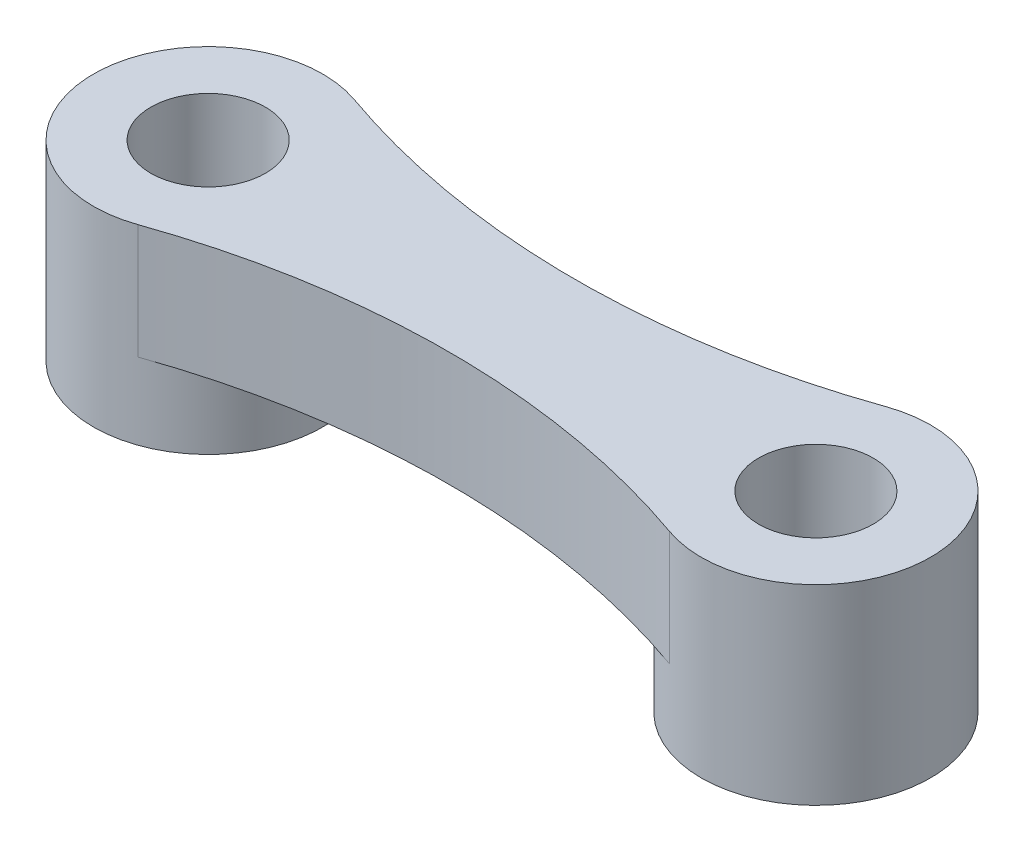
ISO-10303-21;
HEADER;
FILE_DESCRIPTION(('STEP AP214'),'2;1');
FILE_NAME('part.step','',(''),(''),'','','');
FILE_SCHEMA(('AUTOMOTIVE_DESIGN { 1 0 10303 214 1 1 1 1 }'));
ENDSEC;
DATA;
#1=APPLICATION_CONTEXT('core data for automotive mechanical design processes');
#2=APPLICATION_PROTOCOL_DEFINITION('international standard','automotive_design',2000,#1);
#3=PRODUCT_CONTEXT('',#1,'mechanical');
#4=PRODUCT('Part','Part','',(#3));
#5=PRODUCT_RELATED_PRODUCT_CATEGORY('part','',(#4));
#6=PRODUCT_DEFINITION_FORMATION('','',#4);
#7=PRODUCT_DEFINITION_CONTEXT('part definition',#1,'design');
#8=PRODUCT_DEFINITION('design','',#6,#7);
#9=PRODUCT_DEFINITION_SHAPE('','',#8);
#10=(LENGTH_UNIT() NAMED_UNIT(*) SI_UNIT(.MILLI.,.METRE.));
#11=(NAMED_UNIT(*) PLANE_ANGLE_UNIT() SI_UNIT($,.RADIAN.));
#12=(NAMED_UNIT(*) SI_UNIT($,.STERADIAN.) SOLID_ANGLE_UNIT());
#13=UNCERTAINTY_MEASURE_WITH_UNIT(LENGTH_MEASURE(1.E-05),#10,'distance_accuracy_value','');
#14=(GEOMETRIC_REPRESENTATION_CONTEXT(3) GLOBAL_UNCERTAINTY_ASSIGNED_CONTEXT((#13)) GLOBAL_UNIT_ASSIGNED_CONTEXT((#10,
#11,#12)) REPRESENTATION_CONTEXT('',''));
#15=CARTESIAN_POINT('',(0.,0.,0.));
#16=DIRECTION('',(0.,0.,1.));
#17=DIRECTION('',(1.,0.,0.));
#18=AXIS2_PLACEMENT_3D('',#15,#16,#17);
#19=CARTESIAN_POINT('',(-7.95,3.,0.));
#20=DIRECTION('',(0.,1.,0.));
#21=DIRECTION('',(0.,0.,1.));
#22=AXIS2_PLACEMENT_3D('',#19,#20,#21);
#23=PLANE('',#22);
#24=CARTESIAN_POINT('',(-7.95,3.,0.));
#25=DIRECTION('',(0.,1.,0.));
#26=DIRECTION('',(0.,0.,1.));
#27=AXIS2_PLACEMENT_3D('',#24,#25,#26);
#28=CIRCLE('',#27,1.5);
#29=CARTESIAN_POINT('',(-7.95,3.,1.5));
#30=VERTEX_POINT('',#29);
#31=EDGE_CURVE('E158',#30,#30,#28,.T.);
#32=ORIENTED_EDGE('',*,*,#31,.F.);
#33=EDGE_LOOP('',(#32));
#34=FACE_BOUND('',#33,.T.);
#35=CARTESIAN_POINT('',(7.95,3.,0.));
#36=DIRECTION('',(0.,1.,0.));
#37=DIRECTION('',(0.,0.,1.));
#38=AXIS2_PLACEMENT_3D('',#35,#36,#37);
#39=CIRCLE('',#38,1.5);
#40=CARTESIAN_POINT('',(7.95,3.,1.5));
#41=VERTEX_POINT('',#40);
#42=EDGE_CURVE('E153',#41,#41,#39,.T.);
#43=ORIENTED_EDGE('',*,*,#42,.F.);
#44=EDGE_LOOP('',(#43));
#45=FACE_BOUND('',#44,.T.);
#46=CARTESIAN_POINT('',(7.95,3.,0.));
#47=DIRECTION('',(0.,1.,0.));
#48=DIRECTION('',(0.,0.,1.));
#49=AXIS2_PLACEMENT_3D('',#46,#47,#48);
#50=CIRCLE('',#49,3.);
#51=CARTESIAN_POINT('',(6.95625,3.,2.83062907098404));
#52=VERTEX_POINT('',#51);
#53=CARTESIAN_POINT('',(6.95625000000001,3.,-2.83062907098404));
#54=VERTEX_POINT('',#53);
#55=EDGE_CURVE('E13',#52,#54,#50,.T.);
#56=ORIENTED_EDGE('',*,*,#55,.T.);
#57=CARTESIAN_POINT('',(0.,3.,-22.6450325678724));
#58=DIRECTION('',(0.,-1.,0.));
#59=DIRECTION('',(0.,0.,1.));
#60=AXIS2_PLACEMENT_3D('',#57,#58,#59);
#61=CIRCLE('',#60,21.);
#62=CARTESIAN_POINT('',(-6.95625,3.,-2.83062907098405));
#63=VERTEX_POINT('',#62);
#64=EDGE_CURVE('E148',#54,#63,#61,.T.);
#65=ORIENTED_EDGE('',*,*,#64,.T.);
#66=CARTESIAN_POINT('',(-7.95,3.,0.));
#67=DIRECTION('',(0.,1.,0.));
#68=DIRECTION('',(0.,0.,1.));
#69=AXIS2_PLACEMENT_3D('',#66,#67,#68);
#70=CIRCLE('',#69,3.);
#71=CARTESIAN_POINT('',(-6.95625,3.,2.83062907098405));
#72=VERTEX_POINT('',#71);
#73=EDGE_CURVE('E87',#63,#72,#70,.T.);
#74=ORIENTED_EDGE('',*,*,#73,.T.);
#75=CARTESIAN_POINT('',(0.,3.,22.6450325678724));
#76=DIRECTION('',(0.,-1.,0.));
#77=DIRECTION('',(0.,0.,-1.));
#78=AXIS2_PLACEMENT_3D('',#75,#76,#77);
#79=CIRCLE('',#78,21.);
#80=EDGE_CURVE('E144',#72,#52,#79,.T.);
#81=ORIENTED_EDGE('',*,*,#80,.T.);
#82=EDGE_LOOP('',(#56,#65,#74,#81));
#83=FACE_BOUND('',#82,.T.);
#84=ADVANCED_FACE('F79',(#34,#45,#83),#23,.T.);
#85=CARTESIAN_POINT('',(-7.95,0.,0.));
#86=DIRECTION('',(0.,1.,0.));
#87=DIRECTION('',(0.,0.,1.));
#88=AXIS2_PLACEMENT_3D('',#85,#86,#87);
#89=PLANE('',#88);
#90=CARTESIAN_POINT('',(0.,0.,-22.6450325678724));
#91=DIRECTION('',(0.,-1.,0.));
#92=DIRECTION('',(0.,0.,1.));
#93=AXIS2_PLACEMENT_3D('',#90,#91,#92);
#94=CIRCLE('',#93,21.);
#95=CARTESIAN_POINT('',(6.95625000000001,0.,-2.83062907098404));
#96=VERTEX_POINT('',#95);
#97=CARTESIAN_POINT('',(-6.95625,0.,-2.83062907098405));
#98=VERTEX_POINT('',#97);
#99=EDGE_CURVE('E123',#96,#98,#94,.T.);
#100=ORIENTED_EDGE('',*,*,#99,.F.);
#101=CARTESIAN_POINT('',(7.95,0.,0.));
#102=DIRECTION('',(0.,1.,0.));
#103=DIRECTION('',(0.,0.,1.));
#104=AXIS2_PLACEMENT_3D('',#101,#102,#103);
#105=CIRCLE('',#104,3.);
#106=CARTESIAN_POINT('',(6.95625,0.,2.83062907098405));
#107=VERTEX_POINT('',#106);
#108=EDGE_CURVE('E117',#96,#107,#105,.T.);
#109=ORIENTED_EDGE('',*,*,#108,.T.);
#110=CARTESIAN_POINT('',(0.,0.,22.6450325678724));
#111=DIRECTION('',(0.,-1.,0.));
#112=DIRECTION('',(0.,0.,-1.));
#113=AXIS2_PLACEMENT_3D('',#110,#111,#112);
#114=CIRCLE('',#113,21.);
#115=CARTESIAN_POINT('',(-6.95625,0.,2.83062907098405));
#116=VERTEX_POINT('',#115);
#117=EDGE_CURVE('E121',#116,#107,#114,.T.);
#118=ORIENTED_EDGE('',*,*,#117,.F.);
#119=CARTESIAN_POINT('',(-7.95,0.,0.));
#120=DIRECTION('',(0.,1.,0.));
#121=DIRECTION('',(0.,0.,1.));
#122=AXIS2_PLACEMENT_3D('',#119,#120,#121);
#123=CIRCLE('',#122,3.);
#124=EDGE_CURVE('E94',#116,#98,#123,.T.);
#125=ORIENTED_EDGE('',*,*,#124,.T.);
#126=EDGE_LOOP('',(#100,#109,#118,#125));
#127=FACE_BOUND('',#126,.T.);
#128=ADVANCED_FACE('F119',(#127),#89,.F.);
#129=CARTESIAN_POINT('',(-7.95,3.,0.));
#130=DIRECTION('',(0.,-1.,0.));
#131=DIRECTION('',(0.,0.,-1.));
#132=AXIS2_PLACEMENT_3D('',#129,#130,#131);
#133=CYLINDRICAL_SURFACE('',#132,3.);
#134=DIRECTION('',(0.,1.,0.));
#135=VECTOR('',#134,1.);
#136=CARTESIAN_POINT('',(-6.95625,0.,-2.83062907098405));
#137=LINE('',#136,#135);
#138=EDGE_CURVE('E141',#98,#63,#137,.T.);
#139=ORIENTED_EDGE('',*,*,#138,.F.);
#140=ORIENTED_EDGE('',*,*,#124,.F.);
#141=DIRECTION('',(0.,1.,0.));
#142=VECTOR('',#141,1.);
#143=CARTESIAN_POINT('',(-6.95625,0.,2.83062907098405));
#144=LINE('',#143,#142);
#145=EDGE_CURVE('E138',#116,#72,#144,.T.);
#146=ORIENTED_EDGE('',*,*,#145,.T.);
#147=ORIENTED_EDGE('',*,*,#73,.F.);
#148=EDGE_LOOP('',(#139,#140,#146,#147));
#149=FACE_BOUND('',#148,.T.);
#150=CARTESIAN_POINT('',(-7.95,-2.,0.));
#151=DIRECTION('',(0.,1.,0.));
#152=DIRECTION('',(0.,0.,1.));
#153=AXIS2_PLACEMENT_3D('',#150,#151,#152);
#154=CIRCLE('',#153,3.);
#155=CARTESIAN_POINT('',(-7.95,-2.,3.));
#156=VERTEX_POINT('',#155);
#157=EDGE_CURVE('E151',#156,#156,#154,.T.);
#158=ORIENTED_EDGE('',*,*,#157,.T.);
#159=EDGE_LOOP('',(#158));
#160=FACE_BOUND('',#159,.T.);
#161=ADVANCED_FACE('F81',(#149,#160),#133,.T.);
#162=CARTESIAN_POINT('',(7.95,3.,0.));
#163=DIRECTION('',(0.,-1.,0.));
#164=DIRECTION('',(0.,0.,-1.));
#165=AXIS2_PLACEMENT_3D('',#162,#163,#164);
#166=CYLINDRICAL_SURFACE('',#165,3.);
#167=DIRECTION('',(0.,1.,0.));
#168=VECTOR('',#167,1.);
#169=CARTESIAN_POINT('',(6.95625,0.,2.83062907098404));
#170=LINE('',#169,#168);
#171=EDGE_CURVE('E131',#107,#52,#170,.T.);
#172=ORIENTED_EDGE('',*,*,#171,.F.);
#173=ORIENTED_EDGE('',*,*,#108,.F.);
#174=DIRECTION('',(0.,1.,0.));
#175=VECTOR('',#174,1.);
#176=CARTESIAN_POINT('',(6.95625000000001,0.,-2.83062907098404));
#177=LINE('',#176,#175);
#178=EDGE_CURVE('E137',#96,#54,#177,.T.);
#179=ORIENTED_EDGE('',*,*,#178,.T.);
#180=ORIENTED_EDGE('',*,*,#55,.F.);
#181=EDGE_LOOP('',(#172,#173,#179,#180));
#182=FACE_BOUND('',#181,.T.);
#183=CARTESIAN_POINT('',(7.95,-2.,0.));
#184=DIRECTION('',(0.,1.,0.));
#185=DIRECTION('',(0.,0.,1.));
#186=AXIS2_PLACEMENT_3D('',#183,#184,#185);
#187=CIRCLE('',#186,3.);
#188=CARTESIAN_POINT('',(7.95,-2.,3.));
#189=VERTEX_POINT('',#188);
#190=EDGE_CURVE('E127',#189,#189,#187,.T.);
#191=ORIENTED_EDGE('',*,*,#190,.T.);
#192=EDGE_LOOP('',(#191));
#193=FACE_BOUND('',#192,.T.);
#194=ADVANCED_FACE('F132',(#182,#193),#166,.T.);
#195=CARTESIAN_POINT('',(-7.95,3.,0.));
#196=DIRECTION('',(0.,-1.,0.));
#197=DIRECTION('',(0.,0.,-1.));
#198=AXIS2_PLACEMENT_3D('',#195,#196,#197);
#199=CYLINDRICAL_SURFACE('',#198,1.5);
#200=ORIENTED_EDGE('',*,*,#31,.T.);
#201=EDGE_LOOP('',(#200));
#202=FACE_BOUND('',#201,.T.);
#203=CARTESIAN_POINT('',(-7.95,-2.,0.));
#204=DIRECTION('',(0.,1.,0.));
#205=DIRECTION('',(0.,0.,1.));
#206=AXIS2_PLACEMENT_3D('',#203,#204,#205);
#207=CIRCLE('',#206,1.5);
#208=CARTESIAN_POINT('',(-7.95,-2.,1.5));
#209=VERTEX_POINT('',#208);
#210=EDGE_CURVE('E168',#209,#209,#207,.T.);
#211=ORIENTED_EDGE('',*,*,#210,.F.);
#212=EDGE_LOOP('',(#211));
#213=FACE_BOUND('',#212,.T.);
#214=ADVANCED_FACE('F183',(#202,#213),#199,.F.);
#215=CARTESIAN_POINT('',(7.95,3.,0.));
#216=DIRECTION('',(0.,-1.,0.));
#217=DIRECTION('',(0.,0.,-1.));
#218=AXIS2_PLACEMENT_3D('',#215,#216,#217);
#219=CYLINDRICAL_SURFACE('',#218,1.5);
#220=ORIENTED_EDGE('',*,*,#42,.T.);
#221=EDGE_LOOP('',(#220));
#222=FACE_BOUND('',#221,.T.);
#223=CARTESIAN_POINT('',(7.95,-2.,0.));
#224=DIRECTION('',(0.,1.,0.));
#225=DIRECTION('',(0.,0.,1.));
#226=AXIS2_PLACEMENT_3D('',#223,#224,#225);
#227=CIRCLE('',#226,1.5);
#228=CARTESIAN_POINT('',(7.95,-2.,1.5));
#229=VERTEX_POINT('',#228);
#230=EDGE_CURVE('E128',#229,#229,#227,.T.);
#231=ORIENTED_EDGE('',*,*,#230,.F.);
#232=EDGE_LOOP('',(#231));
#233=FACE_BOUND('',#232,.T.);
#234=ADVANCED_FACE('F180',(#222,#233),#219,.F.);
#235=CARTESIAN_POINT('',(0.,0.,-22.6450325678724));
#236=DIRECTION('',(0.,1.,0.));
#237=DIRECTION('',(0.,0.,1.));
#238=AXIS2_PLACEMENT_3D('',#235,#236,#237);
#239=CYLINDRICAL_SURFACE('',#238,21.);
#240=ORIENTED_EDGE('',*,*,#64,.F.);
#241=ORIENTED_EDGE('',*,*,#178,.F.);
#242=ORIENTED_EDGE('',*,*,#99,.T.);
#243=ORIENTED_EDGE('',*,*,#138,.T.);
#244=EDGE_LOOP('',(#240,#241,#242,#243));
#245=FACE_BOUND('',#244,.T.);
#246=ADVANCED_FACE('F182',(#245),#239,.F.);
#247=CARTESIAN_POINT('',(0.,0.,22.6450325678724));
#248=DIRECTION('',(0.,1.,0.));
#249=DIRECTION('',(0.,0.,1.));
#250=AXIS2_PLACEMENT_3D('',#247,#248,#249);
#251=CYLINDRICAL_SURFACE('',#250,21.);
#252=ORIENTED_EDGE('',*,*,#80,.F.);
#253=ORIENTED_EDGE('',*,*,#145,.F.);
#254=ORIENTED_EDGE('',*,*,#117,.T.);
#255=ORIENTED_EDGE('',*,*,#171,.T.);
#256=EDGE_LOOP('',(#252,#253,#254,#255));
#257=FACE_BOUND('',#256,.T.);
#258=ADVANCED_FACE('F140',(#257),#251,.F.);
#259=CARTESIAN_POINT('',(-7.95,-2.,0.));
#260=DIRECTION('',(0.,1.,0.));
#261=DIRECTION('',(0.,0.,1.));
#262=AXIS2_PLACEMENT_3D('',#259,#260,#261);
#263=PLANE('',#262);
#264=ORIENTED_EDGE('',*,*,#210,.T.);
#265=EDGE_LOOP('',(#264));
#266=FACE_BOUND('',#265,.T.);
#267=ORIENTED_EDGE('',*,*,#157,.F.);
#268=EDGE_LOOP('',(#267));
#269=FACE_BOUND('',#268,.T.);
#270=ADVANCED_FACE('F226',(#266,#269),#263,.F.);
#271=CARTESIAN_POINT('',(7.95,-2.,0.));
#272=DIRECTION('',(0.,1.,0.));
#273=DIRECTION('',(0.,0.,1.));
#274=AXIS2_PLACEMENT_3D('',#271,#272,#273);
#275=PLANE('',#274);
#276=ORIENTED_EDGE('',*,*,#230,.T.);
#277=EDGE_LOOP('',(#276));
#278=FACE_BOUND('',#277,.T.);
#279=ORIENTED_EDGE('',*,*,#190,.F.);
#280=EDGE_LOOP('',(#279));
#281=FACE_BOUND('',#280,.T.);
#282=ADVANCED_FACE('F177',(#278,#281),#275,.F.);
#283=CLOSED_SHELL('',(#84,#128,#161,#194,#214,#234,#246,#258,#270,#282));
#284=MANIFOLD_SOLID_BREP('B2',#283);
#285=ADVANCED_BREP_SHAPE_REPRESENTATION('',(#18,#284),#14);
#286=SHAPE_DEFINITION_REPRESENTATION(#9,#285);
ENDSEC;
END-ISO-10303-21;
